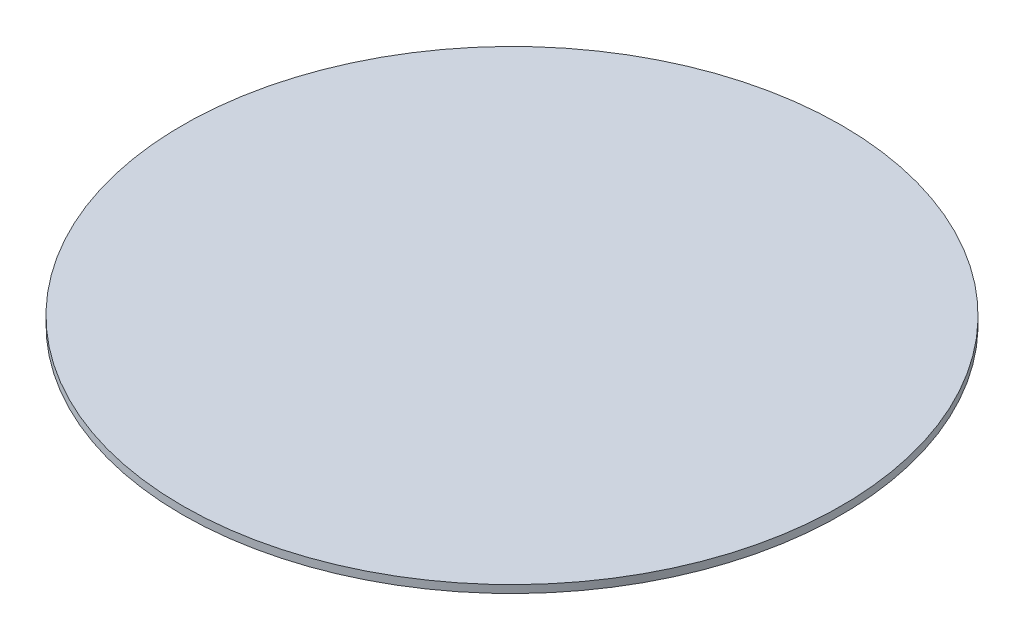
ISO-10303-21;
HEADER;
FILE_DESCRIPTION(('STEP AP214'),'2;1');
FILE_NAME('part.step','',(''),(''),'','','');
FILE_SCHEMA(('AUTOMOTIVE_DESIGN { 1 0 10303 214 1 1 1 1 }'));
ENDSEC;
DATA;
#1=APPLICATION_CONTEXT('core data for automotive mechanical design processes');
#2=APPLICATION_PROTOCOL_DEFINITION('international standard','automotive_design',2000,#1);
#3=PRODUCT_CONTEXT('',#1,'mechanical');
#4=PRODUCT('Part','Part','',(#3));
#5=PRODUCT_RELATED_PRODUCT_CATEGORY('part','',(#4));
#6=PRODUCT_DEFINITION_FORMATION('','',#4);
#7=PRODUCT_DEFINITION_CONTEXT('part definition',#1,'design');
#8=PRODUCT_DEFINITION('design','',#6,#7);
#9=PRODUCT_DEFINITION_SHAPE('','',#8);
#10=(LENGTH_UNIT() NAMED_UNIT(*) SI_UNIT(.MILLI.,.METRE.));
#11=(NAMED_UNIT(*) PLANE_ANGLE_UNIT() SI_UNIT($,.RADIAN.));
#12=(NAMED_UNIT(*) SI_UNIT($,.STERADIAN.) SOLID_ANGLE_UNIT());
#13=UNCERTAINTY_MEASURE_WITH_UNIT(LENGTH_MEASURE(1.E-05),#10,'distance_accuracy_value','');
#14=(GEOMETRIC_REPRESENTATION_CONTEXT(3) GLOBAL_UNCERTAINTY_ASSIGNED_CONTEXT((#13)) GLOBAL_UNIT_ASSIGNED_CONTEXT((#10,
#11,#12)) REPRESENTATION_CONTEXT('',''));
#15=CARTESIAN_POINT('',(0.,0.,0.));
#16=DIRECTION('',(0.,0.,1.));
#17=DIRECTION('',(1.,0.,0.));
#18=AXIS2_PLACEMENT_3D('',#15,#16,#17);
#19=CARTESIAN_POINT('',(0.,20.,0.));
#20=DIRECTION('',(0.,-1.,0.));
#21=DIRECTION('',(0.,0.,-1.));
#22=AXIS2_PLACEMENT_3D('',#19,#20,#21);
#23=CYLINDRICAL_SURFACE('',#22,850.);
#24=CARTESIAN_POINT('',(0.,20.,0.));
#25=DIRECTION('',(0.,1.,0.));
#26=DIRECTION('',(0.,0.,1.));
#27=AXIS2_PLACEMENT_3D('',#24,#25,#26);
#28=CIRCLE('',#27,850.);
#29=CARTESIAN_POINT('',(0.,20.,850.));
#30=VERTEX_POINT('',#29);
#31=EDGE_CURVE('E10',#30,#30,#28,.T.);
#32=ORIENTED_EDGE('',*,*,#31,.F.);
#33=EDGE_LOOP('',(#32));
#34=FACE_BOUND('',#33,.T.);
#35=CARTESIAN_POINT('',(0.,0.,0.));
#36=DIRECTION('',(0.,1.,0.));
#37=DIRECTION('',(0.,0.,1.));
#38=AXIS2_PLACEMENT_3D('',#35,#36,#37);
#39=CIRCLE('',#38,850.);
#40=CARTESIAN_POINT('',(0.,0.,850.));
#41=VERTEX_POINT('',#40);
#42=EDGE_CURVE('E34',#41,#41,#39,.T.);
#43=ORIENTED_EDGE('',*,*,#42,.T.);
#44=EDGE_LOOP('',(#43));
#45=FACE_BOUND('',#44,.T.);
#46=ADVANCED_FACE('F31',(#34,#45),#23,.T.);
#47=CARTESIAN_POINT('',(0.,20.,0.));
#48=DIRECTION('',(0.,1.,0.));
#49=DIRECTION('',(0.,0.,1.));
#50=AXIS2_PLACEMENT_3D('',#47,#48,#49);
#51=PLANE('',#50);
#52=ORIENTED_EDGE('',*,*,#31,.T.);
#53=EDGE_LOOP('',(#52));
#54=FACE_BOUND('',#53,.T.);
#55=ADVANCED_FACE('F46',(#54),#51,.T.);
#56=CARTESIAN_POINT('',(0.,0.,0.));
#57=DIRECTION('',(0.,1.,0.));
#58=DIRECTION('',(0.,0.,1.));
#59=AXIS2_PLACEMENT_3D('',#56,#57,#58);
#60=PLANE('',#59);
#61=ORIENTED_EDGE('',*,*,#42,.F.);
#62=EDGE_LOOP('',(#61));
#63=FACE_BOUND('',#62,.T.);
#64=ADVANCED_FACE('F44',(#63),#60,.F.);
#65=CLOSED_SHELL('',(#46,#55,#64));
#66=MANIFOLD_SOLID_BREP('B2',#65);
#67=ADVANCED_BREP_SHAPE_REPRESENTATION('',(#18,#66),#14);
#68=SHAPE_DEFINITION_REPRESENTATION(#9,#67);
ENDSEC;
END-ISO-10303-21;
